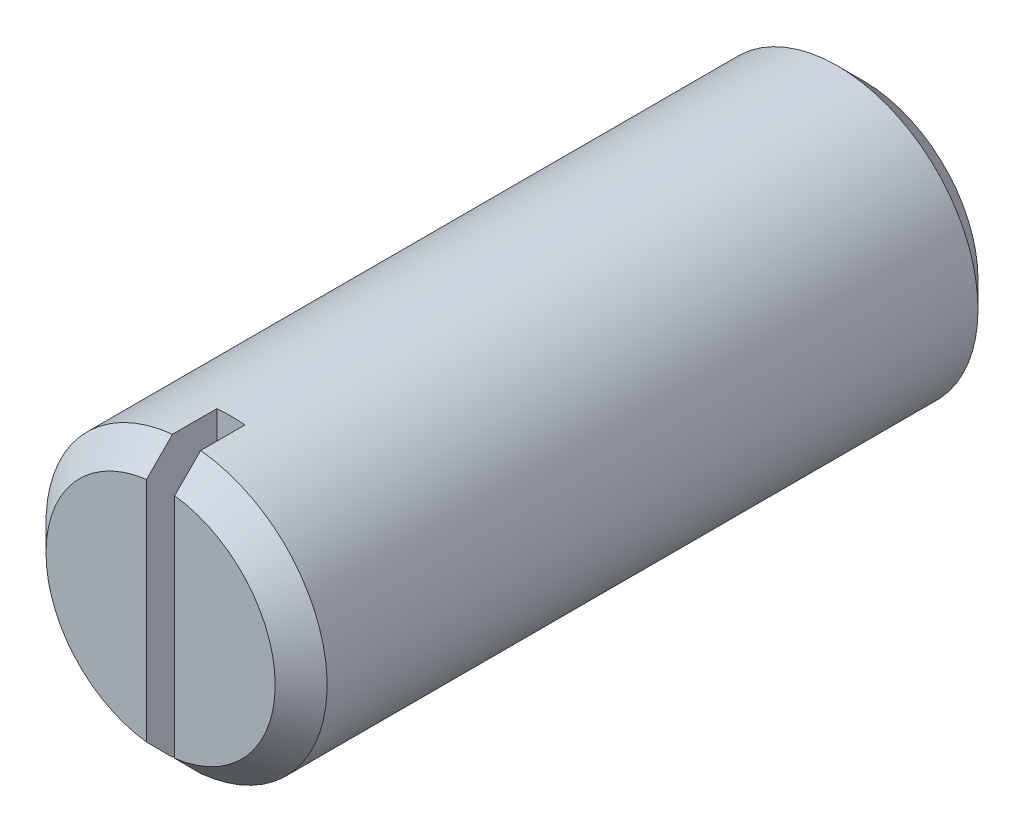
ISO-10303-21;
HEADER;
FILE_DESCRIPTION(('STEP AP214'),'2;1');
FILE_NAME('part.step','',(''),(''),'','','');
FILE_SCHEMA(('AUTOMOTIVE_DESIGN { 1 0 10303 214 1 1 1 1 }'));
ENDSEC;
DATA;
#1=APPLICATION_CONTEXT('core data for automotive mechanical design processes');
#2=APPLICATION_PROTOCOL_DEFINITION('international standard','automotive_design',2000,#1);
#3=PRODUCT_CONTEXT('',#1,'mechanical');
#4=PRODUCT('Part','Part','',(#3));
#5=PRODUCT_RELATED_PRODUCT_CATEGORY('part','',(#4));
#6=PRODUCT_DEFINITION_FORMATION('','',#4);
#7=PRODUCT_DEFINITION_CONTEXT('part definition',#1,'design');
#8=PRODUCT_DEFINITION('design','',#6,#7);
#9=PRODUCT_DEFINITION_SHAPE('','',#8);
#10=(LENGTH_UNIT() NAMED_UNIT(*) SI_UNIT(.MILLI.,.METRE.));
#11=(NAMED_UNIT(*) PLANE_ANGLE_UNIT() SI_UNIT($,.RADIAN.));
#12=(NAMED_UNIT(*) SI_UNIT($,.STERADIAN.) SOLID_ANGLE_UNIT());
#13=UNCERTAINTY_MEASURE_WITH_UNIT(LENGTH_MEASURE(1.E-05),#10,'distance_accuracy_value','');
#14=(GEOMETRIC_REPRESENTATION_CONTEXT(3) GLOBAL_UNCERTAINTY_ASSIGNED_CONTEXT((#13)) GLOBAL_UNIT_ASSIGNED_CONTEXT((#10,
#11,#12)) REPRESENTATION_CONTEXT('',''));
#15=CARTESIAN_POINT('',(0.,0.,0.));
#16=DIRECTION('',(0.,0.,1.));
#17=DIRECTION('',(1.,0.,0.));
#18=AXIS2_PLACEMENT_3D('',#15,#16,#17);
#19=CARTESIAN_POINT('',(0.,0.,15.));
#20=DIRECTION('',(0.,0.,1.));
#21=DIRECTION('',(1.,0.,0.));
#22=AXIS2_PLACEMENT_3D('',#19,#20,#21);
#23=PLANE('',#22);
#24=DIRECTION('',(0.,0.999999999999986,0.));
#25=VECTOR('',#24,1.);
#26=CARTESIAN_POINT('',(0.30000000000005,-3.5,15.));
#27=LINE('',#26,#25);
#28=CARTESIAN_POINT('',(0.30000000000004,-2.42702909953713,15.));
#29=VERTEX_POINT('',#28);
#30=CARTESIAN_POINT('',(0.29999999999997,2.42702909953713,15.));
#31=VERTEX_POINT('',#30);
#32=EDGE_CURVE('E105',#29,#31,#27,.T.);
#33=ORIENTED_EDGE('',*,*,#32,.F.);
#34=CARTESIAN_POINT('',(0.,0.,15.));
#35=DIRECTION('',(0.,0.,1.));
#36=DIRECTION('',(1.,0.,0.));
#37=AXIS2_PLACEMENT_3D('',#34,#35,#36);
#38=CIRCLE('',#37,2.4455);
#39=EDGE_CURVE('E114',#29,#31,#38,.T.);
#40=ORIENTED_EDGE('',*,*,#39,.T.);
#41=EDGE_LOOP('',(#33,#40));
#42=FACE_BOUND('',#41,.T.);
#43=ADVANCED_FACE('F50',(#42),#23,.T.);
#44=CARTESIAN_POINT('',(0.,0.,15.));
#45=DIRECTION('',(0.,0.,-1.));
#46=DIRECTION('',(-1.,0.,0.));
#47=AXIS2_PLACEMENT_3D('',#44,#45,#46);
#48=CONICAL_SURFACE('',#47,2.4455,0.785398163397446);
#49=CARTESIAN_POINT('',(0.300000000000094,-6.60873516066968,10.8299591737431));
#50=CARTESIAN_POINT('',(0.300000000000044,-6.38077478504074,11.0576830900322));
#51=CARTESIAN_POINT('',(0.300000000000026,-6.15280411678112,11.2853967078736));
#52=CARTESIAN_POINT('',(0.300000000000016,-5.69682768610233,11.7407908678273));
#53=CARTESIAN_POINT('',(0.300000000000025,-5.46882192352898,11.9684714097852));
#54=CARTESIAN_POINT('',(0.300000000000035,-5.01273912911707,12.4238085682031));
#55=CARTESIAN_POINT('',(0.300000000000037,-4.78466209233109,12.6514651797077));
#56=CARTESIAN_POINT('',(0.300000000000042,-4.3284370329405,13.1067052660414));
#57=CARTESIAN_POINT('',(0.300000000000045,-4.10028901065326,13.3342887411885));
#58=CARTESIAN_POINT('',(0.300000000000052,-3.64287626459336,13.7903344662649));
#59=CARTESIAN_POINT('',(0.300000000000055,-3.41361102603245,14.0187961998309));
#60=CARTESIAN_POINT('',(0.30000000000006,-2.95487336813218,14.475517667692));
#61=CARTESIAN_POINT('',(0.300000000000062,-2.72540094615526,14.7037773993401));
#62=CARTESIAN_POINT('',(0.30000000000007,-2.38087703810093,15.0458344695701));
#63=CARTESIAN_POINT('',(0.300000000000073,-2.26598694958302,15.1597943527437));
#64=CARTESIAN_POINT('',(0.300000000000071,-2.0360361893503,15.3875432423445));
#65=CARTESIAN_POINT('',(0.300000000000066,-1.92097551676428,15.501332247893));
#66=CARTESIAN_POINT('',(0.300000000000087,-1.69057236663882,15.7286189796904));
#67=CARTESIAN_POINT('',(0.300000000000114,-1.57522989588543,15.8421167128211));
#68=CARTESIAN_POINT('',(0.300000000000048,-1.34403774830485,16.0685941102575));
#69=CARTESIAN_POINT('',(0.299999999999956,-1.22818807718575,16.1815737803643));
#70=CARTESIAN_POINT('',(0.300000000000042,-1.07999945460208,16.324636792881));
#71=CARTESIAN_POINT('',(0.300000000000072,-1.04818671580092,16.355264498533));
#72=CARTESIAN_POINT('',(0.300000000000102,-0.984444543849485,16.4163983792751));
#73=CARTESIAN_POINT('',(0.300000000000101,-0.952515110083073,16.4469045537218));
#74=CARTESIAN_POINT('',(0.300000000000063,-0.856525509472846,16.5381788754609));
#75=CARTESIAN_POINT('',(0.299999999999989,-0.792247103856003,16.5987192387199));
#76=CARTESIAN_POINT('',(0.300000000000035,-0.68399688901546,16.6987860396949));
#77=CARTESIAN_POINT('',(0.3000000000001,-0.64033410531676,16.7386454181745));
#78=CARTESIAN_POINT('',(0.300000000000086,-0.552142087007763,16.8174390565825));
#79=CARTESIAN_POINT('',(0.300000000000008,-0.507612485213754,16.8563729082334));
#80=CARTESIAN_POINT('',(0.300000000000011,-0.426471352432978,16.9244516996784));
#81=CARTESIAN_POINT('',(0.300000000000063,-0.390153693607192,16.9539396369325));
#82=CARTESIAN_POINT('',(0.300000000000113,-0.3343487766317,16.9964481933483));
#83=CARTESIAN_POINT('',(0.300000000000125,-0.315523871578955,17.0103317308233));
#84=CARTESIAN_POINT('',(0.300000000000069,-0.277263905863464,17.0372245252662));
#85=CARTESIAN_POINT('',(0.299999999999999,-0.257829112895698,17.0502341581507));
#86=CARTESIAN_POINT('',(0.300000000000014,-0.21730030861855,17.0754244406572));
#87=CARTESIAN_POINT('',(0.300000000000104,-0.196170938556472,17.0875492128255));
#88=CARTESIAN_POINT('',(0.300000000000093,-0.152683169837964,17.1094052648086));
#89=CARTESIAN_POINT('',(0.299999999999992,-0.130326551044331,17.1191399043592));
#90=CARTESIAN_POINT('',(0.300000000000023,-0.089797446076926,17.1327782357604));
#91=CARTESIAN_POINT('',(0.300000000000105,-0.0719194456261298,17.1375225369325));
#92=CARTESIAN_POINT('',(0.300000000000096,-0.0356416577387885,17.1439125601529));
#93=CARTESIAN_POINT('',(0.300000000000006,-0.0172437148632614,17.1455681093762));
#94=CARTESIAN_POINT('',(0.300000000000007,0.0195982487015199,17.145427273874));
#95=CARTESIAN_POINT('',(0.300000000000099,0.0380422230909577,17.1436195721157));
#96=CARTESIAN_POINT('',(0.300000000000104,0.0743813150398056,17.136938755825));
#97=CARTESIAN_POINT('',(0.300000000000017,0.0922748091531446,17.1320573445229));
#98=CARTESIAN_POINT('',(0.299999999999995,0.129025961152259,17.1194342767413));
#99=CARTESIAN_POINT('',(0.300000000000075,0.147797823016295,17.1114530756723));
#100=CARTESIAN_POINT('',(0.300000000000131,0.18448037288012,17.0936833839064));
#101=CARTESIAN_POINT('',(0.300000000000106,0.20238927538764,17.0838913332087));
#102=CARTESIAN_POINT('',(0.300000000000102,0.237645218785357,17.063045265743));
#103=CARTESIAN_POINT('',(0.300000000000123,0.254986366761011,17.0519814547102));
#104=CARTESIAN_POINT('',(0.300000000000086,0.289104494774658,17.0290587555122));
#105=CARTESIAN_POINT('',(0.300000000000027,0.30588198784576,17.0172006214844));
#106=CARTESIAN_POINT('',(0.299999999999951,0.3587896926221,16.9784797287074));
#107=CARTESIAN_POINT('',(0.300000000000065,0.394153582105484,16.9505778287106));
#108=CARTESIAN_POINT('',(0.300000000000149,0.463816814781002,16.8934679145034));
#109=CARTESIAN_POINT('',(0.300000000000119,0.498115494748639,16.8642591131505));
#110=CARTESIAN_POINT('',(0.300000000000098,0.566109709985531,16.8050309029759));
#111=CARTESIAN_POINT('',(0.300000000000107,0.599804097388398,16.7750101774791));
#112=CARTESIAN_POINT('',(0.300000000000113,0.66675244512837,16.714502942991));
#113=CARTESIAN_POINT('',(0.300000000000109,0.700006523250275,16.6840165634638));
#114=CARTESIAN_POINT('',(0.300000000000115,0.799101349217344,16.5923136304281));
#115=CARTESIAN_POINT('',(0.300000000000138,0.864516408149331,16.5306378214853));
#116=CARTESIAN_POINT('',(0.30000000000009,0.994693469711137,16.4067344412434));
#117=CARTESIAN_POINT('',(0.300000000000019,1.05945605810578,16.3445074809586));
#118=CARTESIAN_POINT('',(0.299999999999942,1.25272051546796,16.1577992412982));
#119=CARTESIAN_POINT('',(0.300000000000073,1.38071990230942,16.0327982333978));
#120=CARTESIAN_POINT('',(0.300000000000171,1.63616585763679,15.7822304259509));
#121=CARTESIAN_POINT('',(0.300000000000138,1.76361241445223,15.6566636145731));
#122=CARTESIAN_POINT('',(0.300000000000117,2.01825319209206,15.4051710113798));
#123=CARTESIAN_POINT('',(0.300000000000129,2.14544728971955,15.2792450947035));
#124=CARTESIAN_POINT('',(0.300000000000136,2.3996585505231,15.0272170770256));
#125=CARTESIAN_POINT('',(0.300000000000132,2.52667571511765,14.9011149774528));
#126=CARTESIAN_POINT('',(0.30000000000015,2.90765135504201,14.5225557885374));
#127=CARTESIAN_POINT('',(0.300000000000205,3.16144554960773,14.2699333706621));
#128=CARTESIAN_POINT('',(0.300000000000092,3.66880272192269,13.7645156419896));
#129=CARTESIAN_POINT('',(0.299999999999924,3.92236572313962,13.5117203547301));
#130=CARTESIAN_POINT('',(0.29999999999997,4.37874440251244,13.0565147257233));
#131=CARTESIAN_POINT('',(0.300000000000115,4.58158092843078,12.854125287917));
#132=CARTESIAN_POINT('',(0.300000000000221,4.98721166646009,12.4492894204671));
#133=CARTESIAN_POINT('',(0.300000000000181,5.19000587678492,12.2468429890341));
#134=CARTESIAN_POINT('',(0.300000000000172,5.59547391181881,11.8420010099233));
#135=CARTESIAN_POINT('',(0.300000000000202,5.79814775117713,11.6396054769172));
#136=CARTESIAN_POINT('',(0.300000000000168,6.20346228422122,11.2347958595082));
#137=CARTESIAN_POINT('',(0.300000000000105,6.40610297883961,11.032381776039));
#138=CARTESIAN_POINT('',(0.299999999999913,6.60873516066968,10.8299591737431));
#139=B_SPLINE_CURVE_WITH_KNOTS('',3,(#49,#50,#51,#52,#53,#54,#55,#56,#57,#58,#59,#60,#61,#62,
#63,#64,#65,#66,#67,#68,#69,#70,#71,#72,#73,#74,#75,#76,#77,#78,#79,#80,#81,#82,#83,#84,#85,#86,
#87,#88,#89,#90,#91,#92,#93,#94,#95,#96,#97,#98,#99,#100,#101,#102,#103,#104,#105,#106,#107,
#108,#109,#110,#111,#112,#113,#114,#115,#116,#117,#118,#119,#120,#121,#122,#123,#124,#125,#126,
#127,#128,#129,#130,#131,#132,#133,#134,#135,#136,#137,#138),.UNSPECIFIED.,.F.,.F.,(4,2,2,2,2,2,
2,2,2,2,2,2,2,2,2,2,2,2,2,2,2,2,2,2,2,2,2,2,2,2,2,2,2,2,2,2,2,2,2,2,2,2,2,2,4),(0.,
0.966652494050248,1.93330936365544,2.90006682754551,3.8668200296036,4.83780704199645,
5.80880659503902,6.29427464024523,6.77974517343786,7.26520412890251,7.75065763492746,
7.88313732305123,8.0156177116667,8.28050772036405,8.45786102446697,8.63529116466318,
8.77557791598233,8.84573469312802,8.9158610959575,8.98886341911138,9.06176252998669,
9.1170447689572,9.17215081998879,9.22743725091398,9.2828735583116,9.34392240262109,
9.40509256568368,9.46677013625485,9.5283899575461,9.6634493424062,9.79859119790766,
9.93396718083012,10.0693061870487,10.3390129609839,10.6084509967951,11.1451770429726,
11.6819143650598,12.2188692112697,12.7558197275526,13.8300940922084,14.9042434568284,
15.7638580411568,16.6235035712208,17.4827856712331,18.3420367429726),.UNSPECIFIED.);
#140=CARTESIAN_POINT('',(0.300000000000047,-2.98496231131986,14.4455));
#141=VERTEX_POINT('',#140);
#142=EDGE_CURVE('E102',#141,#29,#139,.T.);
#143=ORIENTED_EDGE('',*,*,#142,.F.);
#144=CARTESIAN_POINT('',(0.,0.,14.4455));
#145=DIRECTION('',(0.,0.,1.));
#146=DIRECTION('',(1.,0.,0.));
#147=AXIS2_PLACEMENT_3D('',#144,#145,#146);
#148=CIRCLE('',#147,3.);
#149=CARTESIAN_POINT('',(0.29999999999997,2.98496231131986,14.4455));
#150=VERTEX_POINT('',#149);
#151=EDGE_CURVE('E220',#150,#141,#148,.F.);
#152=ORIENTED_EDGE('',*,*,#151,.F.);
#153=EDGE_CURVE('E111',#31,#150,#139,.T.);
#154=ORIENTED_EDGE('',*,*,#153,.F.);
#155=ORIENTED_EDGE('',*,*,#39,.F.);
#156=EDGE_LOOP('',(#143,#152,#154,#155));
#157=FACE_BOUND('',#156,.T.);
#158=ADVANCED_FACE('F116',(#157),#48,.T.);
#159=CARTESIAN_POINT('',(0.,0.,15.));
#160=DIRECTION('',(0.,0.,-1.));
#161=DIRECTION('',(-1.,0.,0.));
#162=AXIS2_PLACEMENT_3D('',#159,#160,#161);
#163=CYLINDRICAL_SURFACE('',#162,3.);
#164=CARTESIAN_POINT('',(0.,0.,13.5));
#165=DIRECTION('',(0.,0.,-1.));
#166=DIRECTION('',(-1.,0.,0.));
#167=AXIS2_PLACEMENT_3D('',#164,#165,#166);
#168=CIRCLE('',#167,3.);
#169=CARTESIAN_POINT('',(-0.30000000000003,2.98496231131986,13.5));
#170=VERTEX_POINT('',#169);
#171=CARTESIAN_POINT('',(0.29999999999997,2.98496231131986,13.5));
#172=VERTEX_POINT('',#171);
#173=EDGE_CURVE('E13',#170,#172,#168,.T.);
#174=ORIENTED_EDGE('',*,*,#173,.T.);
#175=DIRECTION('',(0.,0.,-1.));
#176=VECTOR('',#175,1.);
#177=CARTESIAN_POINT('',(0.299999999999966,2.98496231131986,15.));
#178=LINE('',#177,#176);
#179=EDGE_CURVE('E221',#172,#150,#178,.F.);
#180=ORIENTED_EDGE('',*,*,#179,.T.);
#181=ORIENTED_EDGE('',*,*,#151,.T.);
#182=DIRECTION('',(0.,0.,-1.));
#183=VECTOR('',#182,1.);
#184=CARTESIAN_POINT('',(0.300000000000044,-2.98496231131986,15.));
#185=LINE('',#184,#183);
#186=CARTESIAN_POINT('',(0.300000000000047,-2.98496231131986,13.5));
#187=VERTEX_POINT('',#186);
#188=EDGE_CURVE('E74',#141,#187,#185,.T.);
#189=ORIENTED_EDGE('',*,*,#188,.T.);
#190=CARTESIAN_POINT('',(-0.299999999999953,-2.98496231131986,13.5));
#191=VERTEX_POINT('',#190);
#192=EDGE_CURVE('E55',#187,#191,#168,.T.);
#193=ORIENTED_EDGE('',*,*,#192,.T.);
#194=DIRECTION('',(0.,0.,-1.));
#195=VECTOR('',#194,1.);
#196=CARTESIAN_POINT('',(-0.299999999999956,-2.98496231131986,15.));
#197=LINE('',#196,#195);
#198=CARTESIAN_POINT('',(-0.299999999999953,-2.98496231131986,14.4455));
#199=VERTEX_POINT('',#198);
#200=EDGE_CURVE('E212',#191,#199,#197,.F.);
#201=ORIENTED_EDGE('',*,*,#200,.T.);
#202=CARTESIAN_POINT('',(-0.30000000000003,2.98496231131986,14.4455));
#203=VERTEX_POINT('',#202);
#204=EDGE_CURVE('E223',#199,#203,#148,.F.);
#205=ORIENTED_EDGE('',*,*,#204,.T.);
#206=DIRECTION('',(0.,0.,-1.));
#207=VECTOR('',#206,1.);
#208=CARTESIAN_POINT('',(-0.300000000000034,2.98496231131986,15.));
#209=LINE('',#208,#207);
#210=EDGE_CURVE('E225',#203,#170,#209,.T.);
#211=ORIENTED_EDGE('',*,*,#210,.T.);
#212=EDGE_LOOP('',(#174,#180,#181,#189,#193,#201,#205,#211));
#213=FACE_BOUND('',#212,.T.);
#214=CARTESIAN_POINT('',(0.,0.,0.554499999999999));
#215=DIRECTION('',(0.,0.,1.));
#216=DIRECTION('',(1.,0.,0.));
#217=AXIS2_PLACEMENT_3D('',#214,#215,#216);
#218=CIRCLE('',#217,3.);
#219=CARTESIAN_POINT('',(3.,0.,0.5545));
#220=VERTEX_POINT('',#219);
#221=EDGE_CURVE('E123',#220,#220,#218,.T.);
#222=ORIENTED_EDGE('',*,*,#221,.T.);
#223=EDGE_LOOP('',(#222));
#224=FACE_BOUND('',#223,.T.);
#225=ADVANCED_FACE('F148',(#213,#224),#163,.T.);
#226=DIRECTION('',(0.,-0.999999999999986,0.));
#227=VECTOR('',#226,1.);
#228=CARTESIAN_POINT('',(-0.29999999999995,-3.5,15.));
#229=LINE('',#228,#227);
#230=CARTESIAN_POINT('',(-0.30000000000003,2.42702909953713,15.));
#231=VERTEX_POINT('',#230);
#232=CARTESIAN_POINT('',(-0.29999999999996,-2.42702909953713,15.));
#233=VERTEX_POINT('',#232);
#234=EDGE_CURVE('E66',#231,#233,#229,.T.);
#235=ORIENTED_EDGE('',*,*,#234,.F.);
#236=EDGE_CURVE('E117',#231,#233,#38,.T.);
#237=ORIENTED_EDGE('',*,*,#236,.T.);
#238=EDGE_LOOP('',(#235,#237));
#239=FACE_BOUND('',#238,.T.);
#240=ADVANCED_FACE('F144',(#239),#23,.T.);
#241=CARTESIAN_POINT('',(0.,0.,0.));
#242=DIRECTION('',(0.,0.,1.));
#243=DIRECTION('',(1.,0.,0.));
#244=AXIS2_PLACEMENT_3D('',#241,#242,#243);
#245=PLANE('',#244);
#246=CARTESIAN_POINT('',(0.,0.,0.));
#247=DIRECTION('',(0.,0.,1.));
#248=DIRECTION('',(1.,0.,0.));
#249=AXIS2_PLACEMENT_3D('',#246,#247,#248);
#250=CIRCLE('',#249,2.4455);
#251=CARTESIAN_POINT('',(2.4455,0.,0.));
#252=VERTEX_POINT('',#251);
#253=EDGE_CURVE('E118',#252,#252,#250,.F.);
#254=ORIENTED_EDGE('',*,*,#253,.T.);
#255=EDGE_LOOP('',(#254));
#256=FACE_BOUND('',#255,.T.);
#257=ADVANCED_FACE('F147',(#256),#245,.F.);
#258=CARTESIAN_POINT('',(0.,0.,0.554499999999999));
#259=DIRECTION('',(0.,0.,1.));
#260=DIRECTION('',(1.,0.,0.));
#261=AXIS2_PLACEMENT_3D('',#258,#259,#260);
#262=CONICAL_SURFACE('',#261,3.,0.785398163397451);
#263=ORIENTED_EDGE('',*,*,#253,.F.);
#264=EDGE_LOOP('',(#263));
#265=FACE_BOUND('',#264,.T.);
#266=ORIENTED_EDGE('',*,*,#221,.F.);
#267=EDGE_LOOP('',(#266));
#268=FACE_BOUND('',#267,.T.);
#269=ADVANCED_FACE('F152',(#265,#268),#262,.T.);
#270=CARTESIAN_POINT('',(-0.300000000000087,6.60873516066968,10.8299591737431));
#271=CARTESIAN_POINT('',(-0.29999999999991,6.38077478504073,11.0576830900322));
#272=CARTESIAN_POINT('',(-0.29999999999984,6.1528041167811,11.2853967078735));
#273=CARTESIAN_POINT('',(-0.299999999999792,5.69682768610231,11.7407908678272));
#274=CARTESIAN_POINT('',(-0.299999999999815,5.46882192352896,11.9684714097852));
#275=CARTESIAN_POINT('',(-0.299999999999836,5.01273912911706,12.4238085682031));
#276=CARTESIAN_POINT('',(-0.299999999999834,4.78466209233108,12.6514651797077));
#277=CARTESIAN_POINT('',(-0.299999999999836,4.3284370329405,13.1067052660414));
#278=CARTESIAN_POINT('',(-0.299999999999841,4.10028901065325,13.3342887411885));
#279=CARTESIAN_POINT('',(-0.299999999999848,3.64287626459337,13.7903344662649));
#280=CARTESIAN_POINT('',(-0.29999999999985,3.41361102603245,14.0187961998309));
#281=CARTESIAN_POINT('',(-0.299999999999858,2.95487336813219,14.475517667692));
#282=CARTESIAN_POINT('',(-0.299999999999864,2.72540094615527,14.7037773993401));
#283=CARTESIAN_POINT('',(-0.299999999999864,2.38087703810095,15.0458344695701));
#284=CARTESIAN_POINT('',(-0.299999999999862,2.26598694958304,15.1597943527437));
#285=CARTESIAN_POINT('',(-0.299999999999876,2.03603618935032,15.3875432423445));
#286=CARTESIAN_POINT('',(-0.299999999999891,1.92097551676429,15.501332247893));
#287=CARTESIAN_POINT('',(-0.299999999999857,1.69057236663884,15.7286189796904));
#288=CARTESIAN_POINT('',(-0.299999999999808,1.57522989588546,15.8421167128211));
#289=CARTESIAN_POINT('',(-0.299999999999949,1.34403774830486,16.0685941102575));
#290=CARTESIAN_POINT('',(-0.300000000000138,1.22818807718573,16.1815737803643));
#291=CARTESIAN_POINT('',(-0.299999999999971,1.07999945460209,16.324636792881));
#292=CARTESIAN_POINT('',(-0.299999999999912,1.04818671580095,16.355264498533));
#293=CARTESIAN_POINT('',(-0.299999999999858,0.984444543849524,16.4163983792751));
#294=CARTESIAN_POINT('',(-0.299999999999864,0.952515110083112,16.4469045537219));
#295=CARTESIAN_POINT('',(-0.29999999999993,0.856525509472867,16.5381788754609));
#296=CARTESIAN_POINT('',(-0.300000000000038,0.792247103855985,16.5987192387199));
#297=CARTESIAN_POINT('',(-0.299999999999974,0.683996889015472,16.6987860396949));
#298=CARTESIAN_POINT('',(-0.299999999999883,0.640334105316811,16.7386454181746));
#299=CARTESIAN_POINT('',(-0.299999999999898,0.552142087007806,16.8174390565825));
#300=CARTESIAN_POINT('',(-0.300000000000005,0.50761248521375,16.8563729082334));
#301=CARTESIAN_POINT('',(-0.300000000000002,0.42647135243298,16.9244516996784));
#302=CARTESIAN_POINT('',(-0.299999999999933,0.390153693607227,16.9539396369326));
#303=CARTESIAN_POINT('',(-0.299999999999875,0.334348776631781,16.9964481933484));
#304=CARTESIAN_POINT('',(-0.299999999999862,0.31552387157905,17.0103317308234));
#305=CARTESIAN_POINT('',(-0.299999999999927,0.277263905863519,17.0372245252663));
#306=CARTESIAN_POINT('',(-0.300000000000004,0.257829112895697,17.0502341581507));
#307=CARTESIAN_POINT('',(-0.299999999999989,0.217300308618554,17.0754244406572));
#308=CARTESIAN_POINT('',(-0.299999999999891,0.196170938556541,17.0875492128256));
#309=CARTESIAN_POINT('',(-0.299999999999902,0.152683169838032,17.1094052648087));
#310=CARTESIAN_POINT('',(-0.30000000000001,0.130326551044334,17.1191399043591));
#311=CARTESIAN_POINT('',(-0.29999999999998,0.08979744607692,17.1327782357604));
#312=CARTESIAN_POINT('',(-0.299999999999895,0.0719194456261536,17.1375225369327));
#313=CARTESIAN_POINT('',(-0.299999999999901,0.0356416577388221,17.1439125601531));
#314=CARTESIAN_POINT('',(-0.299999999999993,0.0172437148632751,17.1455681093762));
#315=CARTESIAN_POINT('',(-0.299999999999994,-0.0195982487015453,17.145427273874));
#316=CARTESIAN_POINT('',(-0.299999999999904,-0.0380422230910023,17.1436195721159));
#317=CARTESIAN_POINT('',(-0.299999999999896,-0.0743813150398352,17.1369387558251));
#318=CARTESIAN_POINT('',(-0.299999999999979,-0.09227480915314,17.1320573445229));
#319=CARTESIAN_POINT('',(-0.300000000000002,-0.129025961152271,17.1194342767413));
#320=CARTESIAN_POINT('',(-0.299999999999927,-0.147797823016365,17.1114530756724));
#321=CARTESIAN_POINT('',(-0.299999999999875,-0.184480372880226,17.0936833839066));
#322=CARTESIAN_POINT('',(-0.299999999999899,-0.202389275387723,17.0838913332088));
#323=CARTESIAN_POINT('',(-0.299999999999905,-0.237645218785426,17.0630452657431));
#324=CARTESIAN_POINT('',(-0.299999999999886,-0.254986366761087,17.0519814547103));
#325=CARTESIAN_POINT('',(-0.299999999999919,-0.28910449477471,17.0290587555123));
#326=CARTESIAN_POINT('',(-0.299999999999972,-0.305881987845779,17.0172006214844));
#327=CARTESIAN_POINT('',(-0.300000000000041,-0.358789692622078,16.9784797287073));
#328=CARTESIAN_POINT('',(-0.299999999999941,-0.394153582105538,16.9505778287106));
#329=CARTESIAN_POINT('',(-0.299999999999869,-0.463816814781113,16.8934679145034));
#330=CARTESIAN_POINT('',(-0.299999999999896,-0.49811549474873,16.8642591131506));
#331=CARTESIAN_POINT('',(-0.299999999999917,-0.5661097099856,16.8050309029759));
#332=CARTESIAN_POINT('',(-0.29999999999991,-0.599804097388465,16.7750101774791));
#333=CARTESIAN_POINT('',(-0.299999999999906,-0.666752445128426,16.714502942991));
#334=CARTESIAN_POINT('',(-0.299999999999909,-0.700006523250322,16.6840165634639));
#335=CARTESIAN_POINT('',(-0.299999999999909,-0.799101349217378,16.5923136304281));
#336=CARTESIAN_POINT('',(-0.299999999999898,-0.864516408149367,16.5306378214853));
#337=CARTESIAN_POINT('',(-0.299999999999925,-0.994693469711163,16.4067344412435));
#338=CARTESIAN_POINT('',(-0.299999999999962,-1.0594560581058,16.3445074809586));
#339=CARTESIAN_POINT('',(-0.300000000000005,-1.25272051546797,16.1577992412982));
#340=CARTESIAN_POINT('',(-0.299999999999942,-1.38071990230946,16.0327982333978));
#341=CARTESIAN_POINT('',(-0.299999999999897,-1.63616585763686,15.7822304259509));
#342=CARTESIAN_POINT('',(-0.299999999999916,-1.76361241445229,15.6566636145731));
#343=CARTESIAN_POINT('',(-0.299999999999933,-2.01825319209212,15.4051710113797));
#344=CARTESIAN_POINT('',(-0.29999999999993,-2.14544728971962,15.2792450947035));
#345=CARTESIAN_POINT('',(-0.29999999999993,-2.39965855052317,15.0272170770255));
#346=CARTESIAN_POINT('',(-0.299999999999932,-2.52667571511772,14.9011149774527));
#347=CARTESIAN_POINT('',(-0.299999999999941,-2.90765135504208,14.5225557885374));
#348=CARTESIAN_POINT('',(-0.299999999999949,-3.16144554960781,14.269933370662));
#349=CARTESIAN_POINT('',(-0.299999999999942,-3.66880272192277,13.7645156419895));
#350=CARTESIAN_POINT('',(-0.299999999999927,-3.92236572313968,13.5117203547301));
#351=CARTESIAN_POINT('',(-0.299999999999938,-4.37874440251251,13.0565147257232));
#352=CARTESIAN_POINT('',(-0.299999999999956,-4.58158092843086,12.854125287917));
#353=CARTESIAN_POINT('',(-0.299999999999971,-4.98721166646017,12.4492894204671));
#354=CARTESIAN_POINT('',(-0.299999999999969,-5.19000587678498,12.2468429890341));
#355=CARTESIAN_POINT('',(-0.299999999999975,-5.59547391181887,11.8420010099233));
#356=CARTESIAN_POINT('',(-0.299999999999985,-5.79814775117718,11.6396054769172));
#357=CARTESIAN_POINT('',(-0.299999999999976,-6.20346228422126,11.2347958595082));
#358=CARTESIAN_POINT('',(-0.299999999999958,-6.40610297883963,11.032381776039));
#359=CARTESIAN_POINT('',(-0.299999999999906,-6.60873516066968,10.8299591737431));
#360=B_SPLINE_CURVE_WITH_KNOTS('',3,(#270,#271,#272,#273,#274,#275,#276,#277,#278,#279,#280,
#281,#282,#283,#284,#285,#286,#287,#288,#289,#290,#291,#292,#293,#294,#295,#296,#297,#298,#299,
#300,#301,#302,#303,#304,#305,#306,#307,#308,#309,#310,#311,#312,#313,#314,#315,#316,#317,#318,
#319,#320,#321,#322,#323,#324,#325,#326,#327,#328,#329,#330,#331,#332,#333,#334,#335,#336,#337,
#338,#339,#340,#341,#342,#343,#344,#345,#346,#347,#348,#349,#350,#351,#352,#353,#354,#355,#356,
#357,#358,#359),.UNSPECIFIED.,.F.,.F.,(4,2,2,2,2,2,2,2,2,2,2,2,2,2,2,2,2,2,2,2,2,2,2,2,2,2,2,2,
2,2,2,2,2,2,2,2,2,2,2,2,2,2,2,2,4),(0.,0.966652494050248,1.93330936365544,2.90006682754551,
3.86682002960359,4.83780704199644,5.808806595039,6.29427464024521,6.77974517343785,
7.2652041289025,7.75065763492746,7.88313732305123,8.0156177116667,8.28050772036405,
8.45786102446697,8.63529116466319,8.77557791598234,8.84573469312802,8.91586109595752,
8.9888634191114,9.06176252998672,9.11704476895725,9.17215081998886,9.22743725091407,
9.28287355831169,9.34392240262123,9.4050925656838,9.46677013625496,9.52838995754623,
9.66344934240636,9.79859119790784,9.93396718083027,10.0693061870488,10.339012960984,
10.6084509967952,11.1451770429728,11.6819143650599,12.2188692112699,12.7558197275528,
13.8300940922086,14.9042434568287,15.763858041157,16.623503571221,17.4827856712332,
18.3420367429727),.UNSPECIFIED.);
#361=EDGE_CURVE('E131',#203,#231,#360,.T.);
#362=ORIENTED_EDGE('',*,*,#361,.F.);
#363=ORIENTED_EDGE('',*,*,#204,.F.);
#364=EDGE_CURVE('E121',#233,#199,#360,.T.);
#365=ORIENTED_EDGE('',*,*,#364,.F.);
#366=ORIENTED_EDGE('',*,*,#236,.F.);
#367=EDGE_LOOP('',(#362,#363,#365,#366));
#368=FACE_BOUND('',#367,.T.);
#369=ADVANCED_FACE('F52',(#368),#48,.T.);
#370=CARTESIAN_POINT('',(0.,0.,13.5));
#371=DIRECTION('',(0.,0.,-1.));
#372=DIRECTION('',(-1.,0.,0.));
#373=AXIS2_PLACEMENT_3D('',#370,#371,#372);
#374=PLANE('',#373);
#375=DIRECTION('',(0.,-0.999999999999986,0.));
#376=VECTOR('',#375,1.);
#377=CARTESIAN_POINT('',(-0.299999999999946,-3.5,13.5));
#378=LINE('',#377,#376);
#379=EDGE_CURVE('E208',#170,#191,#378,.T.);
#380=ORIENTED_EDGE('',*,*,#379,.T.);
#381=ORIENTED_EDGE('',*,*,#192,.F.);
#382=DIRECTION('',(0.,0.999999999999986,0.));
#383=VECTOR('',#382,1.);
#384=CARTESIAN_POINT('',(0.300000000000054,-3.5,13.5));
#385=LINE('',#384,#383);
#386=EDGE_CURVE('E213',#187,#172,#385,.T.);
#387=ORIENTED_EDGE('',*,*,#386,.T.);
#388=ORIENTED_EDGE('',*,*,#173,.F.);
#389=EDGE_LOOP('',(#380,#381,#387,#388));
#390=FACE_BOUND('',#389,.T.);
#391=ADVANCED_FACE('F140',(#390),#374,.F.);
#392=CARTESIAN_POINT('',(0.300000000000054,-3.5,13.5));
#393=DIRECTION('',(1.,0.,0.));
#394=DIRECTION('',(0.,0.,-1.));
#395=AXIS2_PLACEMENT_3D('',#392,#393,#394);
#396=PLANE('',#395);
#397=ORIENTED_EDGE('',*,*,#142,.T.);
#398=ORIENTED_EDGE('',*,*,#32,.T.);
#399=ORIENTED_EDGE('',*,*,#153,.T.);
#400=ORIENTED_EDGE('',*,*,#179,.F.);
#401=ORIENTED_EDGE('',*,*,#386,.F.);
#402=ORIENTED_EDGE('',*,*,#188,.F.);
#403=EDGE_LOOP('',(#397,#398,#399,#400,#401,#402));
#404=FACE_BOUND('',#403,.T.);
#405=ADVANCED_FACE('F104',(#404),#396,.F.);
#406=CARTESIAN_POINT('',(-0.299999999999946,-3.5,13.5));
#407=DIRECTION('',(-1.,0.,0.));
#408=DIRECTION('',(0.,0.,1.));
#409=AXIS2_PLACEMENT_3D('',#406,#407,#408);
#410=PLANE('',#409);
#411=ORIENTED_EDGE('',*,*,#361,.T.);
#412=ORIENTED_EDGE('',*,*,#234,.T.);
#413=ORIENTED_EDGE('',*,*,#364,.T.);
#414=ORIENTED_EDGE('',*,*,#200,.F.);
#415=ORIENTED_EDGE('',*,*,#379,.F.);
#416=ORIENTED_EDGE('',*,*,#210,.F.);
#417=EDGE_LOOP('',(#411,#412,#413,#414,#415,#416));
#418=FACE_BOUND('',#417,.T.);
#419=ADVANCED_FACE('F136',(#418),#410,.F.);
#420=CLOSED_SHELL('',(#43,#158,#225,#240,#257,#269,#369,#391,#405,#419));
#421=MANIFOLD_SOLID_BREP('B2',#420);
#422=ADVANCED_BREP_SHAPE_REPRESENTATION('',(#18,#421),#14);
#423=SHAPE_DEFINITION_REPRESENTATION(#9,#422);
ENDSEC;
END-ISO-10303-21;
